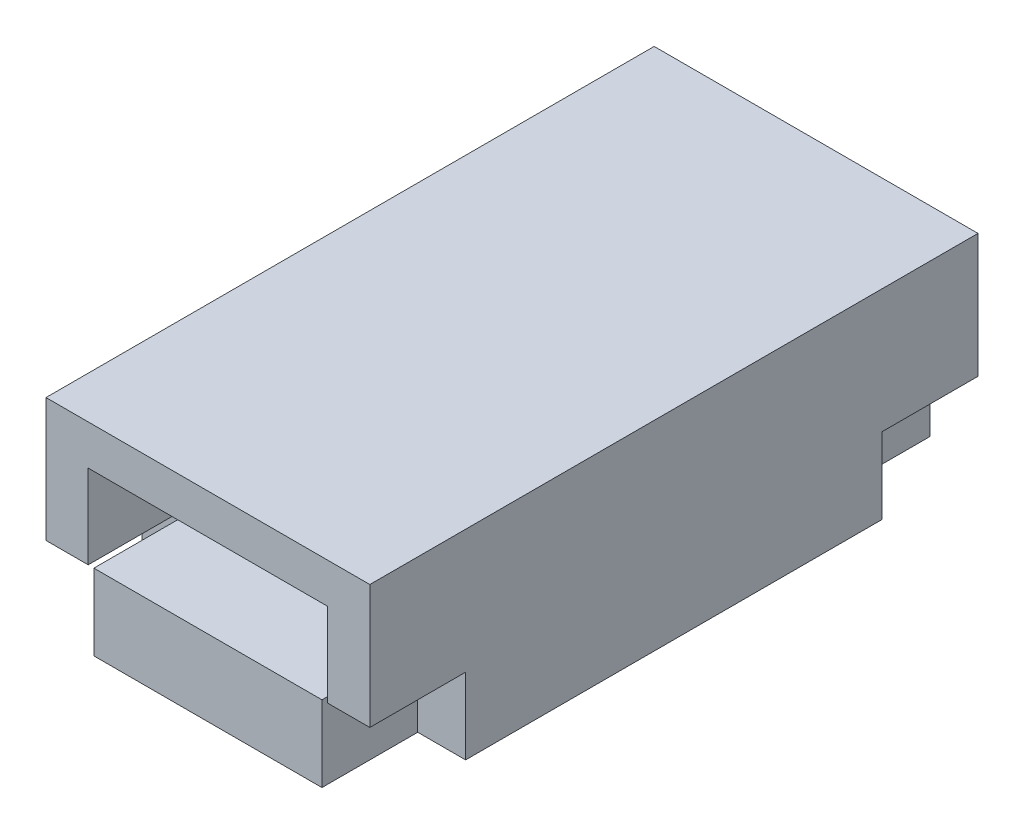
ISO-10303-21;
HEADER;
FILE_DESCRIPTION(('STEP AP214'),'2;1');
FILE_NAME('part.step','',(''),(''),'','','');
FILE_SCHEMA(('AUTOMOTIVE_DESIGN { 1 0 10303 214 1 1 1 1 }'));
ENDSEC;
DATA;
#1=APPLICATION_CONTEXT('core data for automotive mechanical design processes');
#2=APPLICATION_PROTOCOL_DEFINITION('international standard','automotive_design',2000,#1);
#3=PRODUCT_CONTEXT('',#1,'mechanical');
#4=PRODUCT('Part','Part','',(#3));
#5=PRODUCT_RELATED_PRODUCT_CATEGORY('part','',(#4));
#6=PRODUCT_DEFINITION_FORMATION('','',#4);
#7=PRODUCT_DEFINITION_CONTEXT('part definition',#1,'design');
#8=PRODUCT_DEFINITION('design','',#6,#7);
#9=PRODUCT_DEFINITION_SHAPE('','',#8);
#10=(LENGTH_UNIT() NAMED_UNIT(*) SI_UNIT(.MILLI.,.METRE.));
#11=(NAMED_UNIT(*) PLANE_ANGLE_UNIT() SI_UNIT($,.RADIAN.));
#12=(NAMED_UNIT(*) SI_UNIT($,.STERADIAN.) SOLID_ANGLE_UNIT());
#13=UNCERTAINTY_MEASURE_WITH_UNIT(LENGTH_MEASURE(1.E-05),#10,'distance_accuracy_value','');
#14=(GEOMETRIC_REPRESENTATION_CONTEXT(3) GLOBAL_UNCERTAINTY_ASSIGNED_CONTEXT((#13)) GLOBAL_UNIT_ASSIGNED_CONTEXT((#10,
#11,#12)) REPRESENTATION_CONTEXT('',''));
#15=CARTESIAN_POINT('',(0.,0.,0.));
#16=DIRECTION('',(0.,0.,1.));
#17=DIRECTION('',(1.,0.,0.));
#18=AXIS2_PLACEMENT_3D('',#15,#16,#17);
#19=CARTESIAN_POINT('',(-6.7625,-4.925,12.7));
#20=DIRECTION('',(0.,1.,0.));
#21=DIRECTION('',(-1.,0.,0.));
#22=AXIS2_PLACEMENT_3D('',#19,#20,#21);
#23=PLANE('',#22);
#24=DIRECTION('',(0.,0.,-1.));
#25=VECTOR('',#24,1.);
#26=CARTESIAN_POINT('',(-4.7625,-4.925,-8.7));
#27=LINE('',#26,#25);
#28=CARTESIAN_POINT('',(-4.7625,-4.925,-8.7));
#29=VERTEX_POINT('',#28);
#30=CARTESIAN_POINT('',(-4.7625,-4.925,-12.7));
#31=VERTEX_POINT('',#30);
#32=EDGE_CURVE('E253',#29,#31,#27,.T.);
#33=ORIENTED_EDGE('',*,*,#32,.T.);
#34=DIRECTION('',(1.,0.,0.));
#35=VECTOR('',#34,1.);
#36=CARTESIAN_POINT('',(-6.7625,-4.925,-12.7));
#37=LINE('',#36,#35);
#38=CARTESIAN_POINT('',(4.7625,-4.925,-12.7));
#39=VERTEX_POINT('',#38);
#40=EDGE_CURVE('E204',#31,#39,#37,.T.);
#41=ORIENTED_EDGE('',*,*,#40,.T.);
#42=DIRECTION('',(0.,0.,-1.));
#43=VECTOR('',#42,1.);
#44=CARTESIAN_POINT('',(4.7625,-4.925,-8.7));
#45=LINE('',#44,#43);
#46=CARTESIAN_POINT('',(4.7625,-4.925,-8.7));
#47=VERTEX_POINT('',#46);
#48=EDGE_CURVE('E249',#47,#39,#45,.T.);
#49=ORIENTED_EDGE('',*,*,#48,.F.);
#50=DIRECTION('',(1.,0.,0.));
#51=VECTOR('',#50,1.);
#52=CARTESIAN_POINT('',(0.,-4.925,-8.7));
#53=LINE('',#52,#51);
#54=CARTESIAN_POINT('',(6.7625,-4.925,-8.7));
#55=VERTEX_POINT('',#54);
#56=EDGE_CURVE('E274',#47,#55,#53,.T.);
#57=ORIENTED_EDGE('',*,*,#56,.T.);
#58=DIRECTION('',(0.,0.,-1.));
#59=VECTOR('',#58,1.);
#60=CARTESIAN_POINT('',(6.7625,-4.925,12.7));
#61=LINE('',#60,#59);
#62=CARTESIAN_POINT('',(6.7625,-4.925,8.7));
#63=VERTEX_POINT('',#62);
#64=EDGE_CURVE('E50',#63,#55,#61,.T.);
#65=ORIENTED_EDGE('',*,*,#64,.F.);
#66=DIRECTION('',(1.,0.,0.));
#67=VECTOR('',#66,1.);
#68=CARTESIAN_POINT('',(0.,-4.925,8.7));
#69=LINE('',#68,#67);
#70=CARTESIAN_POINT('',(4.7625,-4.925,8.7));
#71=VERTEX_POINT('',#70);
#72=EDGE_CURVE('E329',#71,#63,#69,.T.);
#73=ORIENTED_EDGE('',*,*,#72,.F.);
#74=DIRECTION('',(0.,0.,1.));
#75=VECTOR('',#74,1.);
#76=CARTESIAN_POINT('',(4.7625,-4.925,8.7));
#77=LINE('',#76,#75);
#78=CARTESIAN_POINT('',(4.7625,-4.925,12.7));
#79=VERTEX_POINT('',#78);
#80=EDGE_CURVE('E341',#71,#79,#77,.T.);
#81=ORIENTED_EDGE('',*,*,#80,.T.);
#82=DIRECTION('',(1.,0.,0.));
#83=VECTOR('',#82,1.);
#84=CARTESIAN_POINT('',(-6.7625,-4.925,12.7));
#85=LINE('',#84,#83);
#86=CARTESIAN_POINT('',(-4.7625,-4.925,12.7));
#87=VERTEX_POINT('',#86);
#88=EDGE_CURVE('E403',#87,#79,#85,.T.);
#89=ORIENTED_EDGE('',*,*,#88,.F.);
#90=DIRECTION('',(0.,0.,1.));
#91=VECTOR('',#90,1.);
#92=CARTESIAN_POINT('',(-4.7625,-4.925,8.7));
#93=LINE('',#92,#91);
#94=CARTESIAN_POINT('',(-4.7625,-4.925,8.7));
#95=VERTEX_POINT('',#94);
#96=EDGE_CURVE('E308',#95,#87,#93,.T.);
#97=ORIENTED_EDGE('',*,*,#96,.F.);
#98=DIRECTION('',(1.,0.,0.));
#99=VECTOR('',#98,1.);
#100=CARTESIAN_POINT('',(0.,-4.925,8.7));
#101=LINE('',#100,#99);
#102=CARTESIAN_POINT('',(-6.7625,-4.925,8.7));
#103=VERTEX_POINT('',#102);
#104=EDGE_CURVE('E295',#103,#95,#101,.T.);
#105=ORIENTED_EDGE('',*,*,#104,.F.);
#106=DIRECTION('',(0.,0.,-1.));
#107=VECTOR('',#106,1.);
#108=CARTESIAN_POINT('',(-6.7625,-4.925,12.7));
#109=LINE('',#108,#107);
#110=CARTESIAN_POINT('',(-6.7625,-4.925,-8.7));
#111=VERTEX_POINT('',#110);
#112=EDGE_CURVE('E11',#103,#111,#109,.T.);
#113=ORIENTED_EDGE('',*,*,#112,.T.);
#114=DIRECTION('',(1.,0.,0.));
#115=VECTOR('',#114,1.);
#116=CARTESIAN_POINT('',(0.,-4.925,-8.7));
#117=LINE('',#116,#115);
#118=EDGE_CURVE('E229',#111,#29,#117,.T.);
#119=ORIENTED_EDGE('',*,*,#118,.T.);
#120=EDGE_LOOP('',(#33,#41,#49,#57,#65,#73,#81,#89,#97,#105,#113,#119));
#121=FACE_BOUND('',#120,.T.);
#122=ADVANCED_FACE('F41',(#121),#23,.F.);
#123=CARTESIAN_POINT('',(5.,-1.75,12.7));
#124=DIRECTION('',(0.,1.,0.));
#125=DIRECTION('',(0.,0.,1.));
#126=AXIS2_PLACEMENT_3D('',#123,#124,#125);
#127=PLANE('',#126);
#128=DIRECTION('',(1.,0.,0.));
#129=VECTOR('',#128,1.);
#130=CARTESIAN_POINT('',(5.,-1.75,-12.7));
#131=LINE('',#130,#129);
#132=CARTESIAN_POINT('',(-4.7625,-1.75,-12.7));
#133=VERTEX_POINT('',#132);
#134=CARTESIAN_POINT('',(4.7625,-1.75,-12.7));
#135=VERTEX_POINT('',#134);
#136=EDGE_CURVE('E374',#133,#135,#131,.T.);
#137=ORIENTED_EDGE('',*,*,#136,.F.);
#138=DIRECTION('',(0.,0.,-1.));
#139=VECTOR('',#138,1.);
#140=CARTESIAN_POINT('',(-4.7625,-1.75,-8.7));
#141=LINE('',#140,#139);
#142=CARTESIAN_POINT('',(-4.7625,-1.75,-8.7));
#143=VERTEX_POINT('',#142);
#144=EDGE_CURVE('E258',#143,#133,#141,.T.);
#145=ORIENTED_EDGE('',*,*,#144,.F.);
#146=DIRECTION('',(-1.,0.,0.));
#147=VECTOR('',#146,1.);
#148=CARTESIAN_POINT('',(0.,-1.75,-8.7));
#149=LINE('',#148,#147);
#150=CARTESIAN_POINT('',(-5.,-1.75,-8.7));
#151=VERTEX_POINT('',#150);
#152=EDGE_CURVE('E239',#143,#151,#149,.T.);
#153=ORIENTED_EDGE('',*,*,#152,.T.);
#154=DIRECTION('',(0.,0.,-1.));
#155=VECTOR('',#154,1.);
#156=CARTESIAN_POINT('',(-5.,-1.75,12.7));
#157=LINE('',#156,#155);
#158=CARTESIAN_POINT('',(-5.,-1.75,8.7));
#159=VERTEX_POINT('',#158);
#160=EDGE_CURVE('E400',#159,#151,#157,.T.);
#161=ORIENTED_EDGE('',*,*,#160,.F.);
#162=DIRECTION('',(-1.,0.,0.));
#163=VECTOR('',#162,1.);
#164=CARTESIAN_POINT('',(0.,-1.75,8.7));
#165=LINE('',#164,#163);
#166=CARTESIAN_POINT('',(-4.7625,-1.75,8.7));
#167=VERTEX_POINT('',#166);
#168=EDGE_CURVE('E302',#167,#159,#165,.T.);
#169=ORIENTED_EDGE('',*,*,#168,.F.);
#170=DIRECTION('',(0.,0.,1.));
#171=VECTOR('',#170,1.);
#172=CARTESIAN_POINT('',(-4.7625,-1.75,8.7));
#173=LINE('',#172,#171);
#174=CARTESIAN_POINT('',(-4.7625,-1.75,12.7));
#175=VERTEX_POINT('',#174);
#176=EDGE_CURVE('E319',#167,#175,#173,.T.);
#177=ORIENTED_EDGE('',*,*,#176,.T.);
#178=DIRECTION('',(1.,0.,0.));
#179=VECTOR('',#178,1.);
#180=CARTESIAN_POINT('',(5.,-1.75,12.7));
#181=LINE('',#180,#179);
#182=CARTESIAN_POINT('',(4.7625,-1.75,12.7));
#183=VERTEX_POINT('',#182);
#184=EDGE_CURVE('E359',#175,#183,#181,.T.);
#185=ORIENTED_EDGE('',*,*,#184,.T.);
#186=DIRECTION('',(0.,0.,1.));
#187=VECTOR('',#186,1.);
#188=CARTESIAN_POINT('',(4.7625,-1.75,8.7));
#189=LINE('',#188,#187);
#190=CARTESIAN_POINT('',(4.7625,-1.75,8.7));
#191=VERTEX_POINT('',#190);
#192=EDGE_CURVE('E312',#191,#183,#189,.T.);
#193=ORIENTED_EDGE('',*,*,#192,.F.);
#194=DIRECTION('',(-1.,0.,0.));
#195=VECTOR('',#194,1.);
#196=CARTESIAN_POINT('',(0.,-1.75,8.7));
#197=LINE('',#196,#195);
#198=CARTESIAN_POINT('',(5.,-1.75,8.7));
#199=VERTEX_POINT('',#198);
#200=EDGE_CURVE('E336',#199,#191,#197,.T.);
#201=ORIENTED_EDGE('',*,*,#200,.F.);
#202=DIRECTION('',(0.,0.,-1.));
#203=VECTOR('',#202,1.);
#204=CARTESIAN_POINT('',(5.,-1.75,12.7));
#205=LINE('',#204,#203);
#206=CARTESIAN_POINT('',(5.,-1.75,-8.7));
#207=VERTEX_POINT('',#206);
#208=EDGE_CURVE('E396',#199,#207,#205,.T.);
#209=ORIENTED_EDGE('',*,*,#208,.T.);
#210=DIRECTION('',(-1.,0.,0.));
#211=VECTOR('',#210,1.);
#212=CARTESIAN_POINT('',(0.,-1.75,-8.7));
#213=LINE('',#212,#211);
#214=CARTESIAN_POINT('',(4.7625,-1.75,-8.7));
#215=VERTEX_POINT('',#214);
#216=EDGE_CURVE('E267',#207,#215,#213,.T.);
#217=ORIENTED_EDGE('',*,*,#216,.T.);
#218=DIRECTION('',(0.,0.,-1.));
#219=VECTOR('',#218,1.);
#220=CARTESIAN_POINT('',(4.7625,-1.75,-8.7));
#221=LINE('',#220,#219);
#222=EDGE_CURVE('E277',#215,#135,#221,.T.);
#223=ORIENTED_EDGE('',*,*,#222,.T.);
#224=EDGE_LOOP('',(#137,#145,#153,#161,#169,#177,#185,#193,#201,#209,#217,#223));
#225=FACE_BOUND('',#224,.T.);
#226=ADVANCED_FACE('F434',(#225),#127,.T.);
#227=CARTESIAN_POINT('',(0.,0.,-12.7));
#228=DIRECTION('',(0.,0.,1.));
#229=DIRECTION('',(1.,0.,0.));
#230=AXIS2_PLACEMENT_3D('',#227,#228,#229);
#231=PLANE('',#230);
#232=DIRECTION('',(0.,1.,0.));
#233=VECTOR('',#232,1.);
#234=CARTESIAN_POINT('',(-4.7625,0.,-12.7));
#235=LINE('',#234,#233);
#236=EDGE_CURVE('E234',#31,#133,#235,.T.);
#237=ORIENTED_EDGE('',*,*,#236,.T.);
#238=ORIENTED_EDGE('',*,*,#136,.T.);
#239=DIRECTION('',(0.,1.,0.));
#240=VECTOR('',#239,1.);
#241=CARTESIAN_POINT('',(4.7625,0.,-12.7));
#242=LINE('',#241,#240);
#243=EDGE_CURVE('E223',#39,#135,#242,.T.);
#244=ORIENTED_EDGE('',*,*,#243,.F.);
#245=ORIENTED_EDGE('',*,*,#40,.F.);
#246=EDGE_LOOP('',(#237,#238,#244,#245));
#247=FACE_BOUND('',#246,.T.);
#248=ADVANCED_FACE('F438',(#247),#231,.F.);
#249=DIRECTION('',(-1.,0.,0.));
#250=VECTOR('',#249,1.);
#251=CARTESIAN_POINT('',(0.,-1.75,-12.7));
#252=LINE('',#251,#250);
#253=CARTESIAN_POINT('',(-5.,-1.75,-12.7));
#254=VERTEX_POINT('',#253);
#255=CARTESIAN_POINT('',(-6.7625,-1.75,-12.7));
#256=VERTEX_POINT('',#255);
#257=EDGE_CURVE('E200',#254,#256,#252,.T.);
#258=ORIENTED_EDGE('',*,*,#257,.T.);
#259=DIRECTION('',(0.,-1.,0.));
#260=VECTOR('',#259,1.);
#261=CARTESIAN_POINT('',(-6.7625,2.48121000000001,-12.7));
#262=LINE('',#261,#260);
#263=CARTESIAN_POINT('',(-6.7625,3.42021000000001,-12.7));
#264=VERTEX_POINT('',#263);
#265=EDGE_CURVE('E193',#264,#256,#262,.T.);
#266=ORIENTED_EDGE('',*,*,#265,.F.);
#267=DIRECTION('',(1.,0.,0.));
#268=VECTOR('',#267,1.);
#269=CARTESIAN_POINT('',(0.,3.42021000000001,-12.7));
#270=LINE('',#269,#268);
#271=CARTESIAN_POINT('',(6.7625,3.42021000000001,-12.7));
#272=VERTEX_POINT('',#271);
#273=EDGE_CURVE('E198',#264,#272,#270,.T.);
#274=ORIENTED_EDGE('',*,*,#273,.T.);
#275=DIRECTION('',(0.,1.,0.));
#276=VECTOR('',#275,1.);
#277=CARTESIAN_POINT('',(6.7625,2.48121,-12.7));
#278=LINE('',#277,#276);
#279=CARTESIAN_POINT('',(6.7625,-1.75,-12.7));
#280=VERTEX_POINT('',#279);
#281=EDGE_CURVE('E404',#280,#272,#278,.T.);
#282=ORIENTED_EDGE('',*,*,#281,.F.);
#283=DIRECTION('',(-1.,0.,0.));
#284=VECTOR('',#283,1.);
#285=CARTESIAN_POINT('',(0.,-1.75,-12.7));
#286=LINE('',#285,#284);
#287=CARTESIAN_POINT('',(5.,-1.75,-12.7));
#288=VERTEX_POINT('',#287);
#289=EDGE_CURVE('E226',#280,#288,#286,.T.);
#290=ORIENTED_EDGE('',*,*,#289,.T.);
#291=DIRECTION('',(0.,1.,0.));
#292=VECTOR('',#291,1.);
#293=CARTESIAN_POINT('',(5.,1.75,-12.7));
#294=LINE('',#293,#292);
#295=CARTESIAN_POINT('',(5.,1.75,-12.7));
#296=VERTEX_POINT('',#295);
#297=EDGE_CURVE('E378',#288,#296,#294,.T.);
#298=ORIENTED_EDGE('',*,*,#297,.T.);
#299=DIRECTION('',(-1.,0.,0.));
#300=VECTOR('',#299,1.);
#301=CARTESIAN_POINT('',(5.,1.75,-12.7));
#302=LINE('',#301,#300);
#303=CARTESIAN_POINT('',(-5.,1.75,-12.7));
#304=VERTEX_POINT('',#303);
#305=EDGE_CURVE('E360',#296,#304,#302,.T.);
#306=ORIENTED_EDGE('',*,*,#305,.T.);
#307=DIRECTION('',(0.,-1.,0.));
#308=VECTOR('',#307,1.);
#309=CARTESIAN_POINT('',(-5.,1.75,-12.7));
#310=LINE('',#309,#308);
#311=EDGE_CURVE('E318',#304,#254,#310,.T.);
#312=ORIENTED_EDGE('',*,*,#311,.T.);
#313=EDGE_LOOP('',(#258,#266,#274,#282,#290,#298,#306,#312));
#314=FACE_BOUND('',#313,.T.);
#315=ADVANCED_FACE('F195',(#314),#231,.F.);
#316=CARTESIAN_POINT('',(-6.7625,2.48121000000001,12.7));
#317=DIRECTION('',(1.,0.,0.));
#318=DIRECTION('',(0.,1.,0.));
#319=AXIS2_PLACEMENT_3D('',#316,#317,#318);
#320=PLANE('',#319);
#321=DIRECTION('',(0.,0.,1.));
#322=VECTOR('',#321,1.);
#323=CARTESIAN_POINT('',(-6.7625,3.42021000000001,0.));
#324=LINE('',#323,#322);
#325=CARTESIAN_POINT('',(-6.7625,3.42021000000001,12.7));
#326=VERTEX_POINT('',#325);
#327=EDGE_CURVE('E208',#264,#326,#324,.T.);
#328=ORIENTED_EDGE('',*,*,#327,.F.);
#329=ORIENTED_EDGE('',*,*,#265,.T.);
#330=DIRECTION('',(0.,0.,-1.));
#331=VECTOR('',#330,1.);
#332=CARTESIAN_POINT('',(-6.7625,-1.75,-8.7));
#333=LINE('',#332,#331);
#334=CARTESIAN_POINT('',(-6.7625,-1.75,-8.7));
#335=VERTEX_POINT('',#334);
#336=EDGE_CURVE('E246',#335,#256,#333,.T.);
#337=ORIENTED_EDGE('',*,*,#336,.F.);
#338=DIRECTION('',(0.,-1.,0.));
#339=VECTOR('',#338,1.);
#340=CARTESIAN_POINT('',(-6.7625,0.,-8.7));
#341=LINE('',#340,#339);
#342=EDGE_CURVE('E233',#335,#111,#341,.T.);
#343=ORIENTED_EDGE('',*,*,#342,.T.);
#344=ORIENTED_EDGE('',*,*,#112,.F.);
#345=DIRECTION('',(0.,-1.,0.));
#346=VECTOR('',#345,1.);
#347=CARTESIAN_POINT('',(-6.7625,0.,8.7));
#348=LINE('',#347,#346);
#349=CARTESIAN_POINT('',(-6.7625,-1.75,8.7));
#350=VERTEX_POINT('',#349);
#351=EDGE_CURVE('E305',#350,#103,#348,.T.);
#352=ORIENTED_EDGE('',*,*,#351,.F.);
#353=DIRECTION('',(0.,0.,1.));
#354=VECTOR('',#353,1.);
#355=CARTESIAN_POINT('',(-6.7625,-1.75,8.7));
#356=LINE('',#355,#354);
#357=CARTESIAN_POINT('',(-6.7625,-1.75,12.7));
#358=VERTEX_POINT('',#357);
#359=EDGE_CURVE('E315',#350,#358,#356,.T.);
#360=ORIENTED_EDGE('',*,*,#359,.T.);
#361=DIRECTION('',(0.,-1.,0.));
#362=VECTOR('',#361,1.);
#363=CARTESIAN_POINT('',(-6.7625,2.48121000000001,12.7));
#364=LINE('',#363,#362);
#365=EDGE_CURVE('E211',#326,#358,#364,.T.);
#366=ORIENTED_EDGE('',*,*,#365,.F.);
#367=EDGE_LOOP('',(#328,#329,#337,#343,#344,#352,#360,#366));
#368=FACE_BOUND('',#367,.T.);
#369=ADVANCED_FACE('F43',(#368),#320,.F.);
#370=CARTESIAN_POINT('',(6.7625,2.48121,12.7));
#371=DIRECTION('',(-1.,0.,0.));
#372=DIRECTION('',(0.,0.,1.));
#373=AXIS2_PLACEMENT_3D('',#370,#371,#372);
#374=PLANE('',#373);
#375=ORIENTED_EDGE('',*,*,#281,.T.);
#376=DIRECTION('',(0.,0.,1.));
#377=VECTOR('',#376,1.);
#378=CARTESIAN_POINT('',(6.7625,3.42021000000001,0.));
#379=LINE('',#378,#377);
#380=CARTESIAN_POINT('',(6.7625,3.42021000000001,12.7));
#381=VERTEX_POINT('',#380);
#382=EDGE_CURVE('E217',#272,#381,#379,.T.);
#383=ORIENTED_EDGE('',*,*,#382,.T.);
#384=DIRECTION('',(0.,1.,0.));
#385=VECTOR('',#384,1.);
#386=CARTESIAN_POINT('',(6.7625,2.48121,12.7));
#387=LINE('',#386,#385);
#388=CARTESIAN_POINT('',(6.7625,-1.75,12.7));
#389=VERTEX_POINT('',#388);
#390=EDGE_CURVE('E408',#389,#381,#387,.T.);
#391=ORIENTED_EDGE('',*,*,#390,.F.);
#392=DIRECTION('',(0.,0.,1.));
#393=VECTOR('',#392,1.);
#394=CARTESIAN_POINT('',(6.7625,-1.75,8.7));
#395=LINE('',#394,#393);
#396=CARTESIAN_POINT('',(6.7625,-1.75,8.7));
#397=VERTEX_POINT('',#396);
#398=EDGE_CURVE('E349',#397,#389,#395,.T.);
#399=ORIENTED_EDGE('',*,*,#398,.F.);
#400=DIRECTION('',(0.,1.,0.));
#401=VECTOR('',#400,1.);
#402=CARTESIAN_POINT('',(6.7625,0.,8.7));
#403=LINE('',#402,#401);
#404=EDGE_CURVE('E333',#63,#397,#403,.T.);
#405=ORIENTED_EDGE('',*,*,#404,.F.);
#406=ORIENTED_EDGE('',*,*,#64,.T.);
#407=DIRECTION('',(0.,1.,0.));
#408=VECTOR('',#407,1.);
#409=CARTESIAN_POINT('',(6.7625,0.,-8.7));
#410=LINE('',#409,#408);
#411=CARTESIAN_POINT('',(6.7625,-1.75,-8.7));
#412=VERTEX_POINT('',#411);
#413=EDGE_CURVE('E270',#55,#412,#410,.T.);
#414=ORIENTED_EDGE('',*,*,#413,.T.);
#415=DIRECTION('',(0.,0.,-1.));
#416=VECTOR('',#415,1.);
#417=CARTESIAN_POINT('',(6.7625,-1.75,-8.7));
#418=LINE('',#417,#416);
#419=EDGE_CURVE('E284',#412,#280,#418,.T.);
#420=ORIENTED_EDGE('',*,*,#419,.T.);
#421=EDGE_LOOP('',(#375,#383,#391,#399,#405,#406,#414,#420));
#422=FACE_BOUND('',#421,.T.);
#423=ADVANCED_FACE('F420',(#422),#374,.F.);
#424=CARTESIAN_POINT('',(0.,0.,12.7));
#425=DIRECTION('',(0.,0.,1.));
#426=DIRECTION('',(1.,0.,0.));
#427=AXIS2_PLACEMENT_3D('',#424,#425,#426);
#428=PLANE('',#427);
#429=DIRECTION('',(-1.,0.,0.));
#430=VECTOR('',#429,1.);
#431=CARTESIAN_POINT('',(0.,-1.75,12.7));
#432=LINE('',#431,#430);
#433=CARTESIAN_POINT('',(-5.,-1.75,12.7));
#434=VERTEX_POINT('',#433);
#435=EDGE_CURVE('E298',#434,#358,#432,.T.);
#436=ORIENTED_EDGE('',*,*,#435,.F.);
#437=DIRECTION('',(0.,-1.,0.));
#438=VECTOR('',#437,1.);
#439=CARTESIAN_POINT('',(-5.,1.75,12.7));
#440=LINE('',#439,#438);
#441=CARTESIAN_POINT('',(-5.,1.75,12.7));
#442=VERTEX_POINT('',#441);
#443=EDGE_CURVE('E355',#442,#434,#440,.T.);
#444=ORIENTED_EDGE('',*,*,#443,.F.);
#445=DIRECTION('',(-1.,0.,0.));
#446=VECTOR('',#445,1.);
#447=CARTESIAN_POINT('',(5.,1.75,12.7));
#448=LINE('',#447,#446);
#449=CARTESIAN_POINT('',(5.,1.75,12.7));
#450=VERTEX_POINT('',#449);
#451=EDGE_CURVE('E368',#450,#442,#448,.T.);
#452=ORIENTED_EDGE('',*,*,#451,.F.);
#453=DIRECTION('',(0.,1.,0.));
#454=VECTOR('',#453,1.);
#455=CARTESIAN_POINT('',(5.,1.75,12.7));
#456=LINE('',#455,#454);
#457=CARTESIAN_POINT('',(5.,-1.75,12.7));
#458=VERTEX_POINT('',#457);
#459=EDGE_CURVE('E364',#458,#450,#456,.T.);
#460=ORIENTED_EDGE('',*,*,#459,.F.);
#461=DIRECTION('',(-1.,0.,0.));
#462=VECTOR('',#461,1.);
#463=CARTESIAN_POINT('',(0.,-1.75,12.7));
#464=LINE('',#463,#462);
#465=EDGE_CURVE('E330',#389,#458,#464,.T.);
#466=ORIENTED_EDGE('',*,*,#465,.F.);
#467=ORIENTED_EDGE('',*,*,#390,.T.);
#468=DIRECTION('',(1.,0.,0.));
#469=VECTOR('',#468,1.);
#470=CARTESIAN_POINT('',(0.,3.42021000000001,12.7));
#471=LINE('',#470,#469);
#472=EDGE_CURVE('E257',#326,#381,#471,.T.);
#473=ORIENTED_EDGE('',*,*,#472,.F.);
#474=ORIENTED_EDGE('',*,*,#365,.T.);
#475=EDGE_LOOP('',(#436,#444,#452,#460,#466,#467,#473,#474));
#476=FACE_BOUND('',#475,.T.);
#477=ADVANCED_FACE('F474',(#476),#428,.T.);
#478=DIRECTION('',(0.,1.,0.));
#479=VECTOR('',#478,1.);
#480=CARTESIAN_POINT('',(-4.7625,0.,12.7));
#481=LINE('',#480,#479);
#482=EDGE_CURVE('E309',#87,#175,#481,.T.);
#483=ORIENTED_EDGE('',*,*,#482,.F.);
#484=ORIENTED_EDGE('',*,*,#88,.T.);
#485=DIRECTION('',(0.,1.,0.));
#486=VECTOR('',#485,1.);
#487=CARTESIAN_POINT('',(4.7625,0.,12.7));
#488=LINE('',#487,#486);
#489=EDGE_CURVE('E216',#79,#183,#488,.T.);
#490=ORIENTED_EDGE('',*,*,#489,.T.);
#491=ORIENTED_EDGE('',*,*,#184,.F.);
#492=EDGE_LOOP('',(#483,#484,#490,#491));
#493=FACE_BOUND('',#492,.T.);
#494=ADVANCED_FACE('F513',(#493),#428,.T.);
#495=CARTESIAN_POINT('',(-5.,1.75,12.7));
#496=DIRECTION('',(1.,0.,0.));
#497=DIRECTION('',(0.,1.,0.));
#498=AXIS2_PLACEMENT_3D('',#495,#496,#497);
#499=PLANE('',#498);
#500=ORIENTED_EDGE('',*,*,#311,.F.);
#501=DIRECTION('',(0.,0.,-1.));
#502=VECTOR('',#501,1.);
#503=CARTESIAN_POINT('',(-5.,1.75,12.7));
#504=LINE('',#503,#502);
#505=EDGE_CURVE('E371',#442,#304,#504,.T.);
#506=ORIENTED_EDGE('',*,*,#505,.F.);
#507=ORIENTED_EDGE('',*,*,#443,.T.);
#508=EDGE_CURVE('E205',#434,#159,#157,.T.);
#509=ORIENTED_EDGE('',*,*,#508,.T.);
#510=ORIENTED_EDGE('',*,*,#160,.T.);
#511=EDGE_CURVE('E395',#151,#254,#157,.T.);
#512=ORIENTED_EDGE('',*,*,#511,.T.);
#513=EDGE_LOOP('',(#500,#506,#507,#509,#510,#512));
#514=FACE_BOUND('',#513,.T.);
#515=ADVANCED_FACE('F465',(#514),#499,.T.);
#516=CARTESIAN_POINT('',(5.,1.75,12.7));
#517=DIRECTION('',(-1.,0.,0.));
#518=DIRECTION('',(0.,-1.,0.));
#519=AXIS2_PLACEMENT_3D('',#516,#517,#518);
#520=PLANE('',#519);
#521=ORIENTED_EDGE('',*,*,#297,.F.);
#522=EDGE_CURVE('E391',#207,#288,#205,.T.);
#523=ORIENTED_EDGE('',*,*,#522,.F.);
#524=ORIENTED_EDGE('',*,*,#208,.F.);
#525=EDGE_CURVE('E392',#458,#199,#205,.T.);
#526=ORIENTED_EDGE('',*,*,#525,.F.);
#527=ORIENTED_EDGE('',*,*,#459,.T.);
#528=DIRECTION('',(0.,0.,-1.));
#529=VECTOR('',#528,1.);
#530=CARTESIAN_POINT('',(5.,1.75,12.7));
#531=LINE('',#530,#529);
#532=EDGE_CURVE('E388',#450,#296,#531,.T.);
#533=ORIENTED_EDGE('',*,*,#532,.T.);
#534=EDGE_LOOP('',(#521,#523,#524,#526,#527,#533));
#535=FACE_BOUND('',#534,.T.);
#536=ADVANCED_FACE('F482',(#535),#520,.T.);
#537=CARTESIAN_POINT('',(5.,1.75,12.7));
#538=DIRECTION('',(0.,-1.,0.));
#539=DIRECTION('',(0.,0.,-1.));
#540=AXIS2_PLACEMENT_3D('',#537,#538,#539);
#541=PLANE('',#540);
#542=ORIENTED_EDGE('',*,*,#305,.F.);
#543=ORIENTED_EDGE('',*,*,#532,.F.);
#544=ORIENTED_EDGE('',*,*,#451,.T.);
#545=ORIENTED_EDGE('',*,*,#505,.T.);
#546=EDGE_LOOP('',(#542,#543,#544,#545));
#547=FACE_BOUND('',#546,.T.);
#548=ADVANCED_FACE('F488',(#547),#541,.T.);
#549=CARTESIAN_POINT('',(4.7625,0.,8.7));
#550=DIRECTION('',(1.,0.,0.));
#551=DIRECTION('',(0.,0.,-1.));
#552=AXIS2_PLACEMENT_3D('',#549,#550,#551);
#553=PLANE('',#552);
#554=ORIENTED_EDGE('',*,*,#489,.F.);
#555=ORIENTED_EDGE('',*,*,#80,.F.);
#556=DIRECTION('',(0.,1.,0.));
#557=VECTOR('',#556,1.);
#558=CARTESIAN_POINT('',(4.7625,0.,8.7));
#559=LINE('',#558,#557);
#560=EDGE_CURVE('E325',#71,#191,#559,.T.);
#561=ORIENTED_EDGE('',*,*,#560,.T.);
#562=ORIENTED_EDGE('',*,*,#192,.T.);
#563=EDGE_LOOP('',(#554,#555,#561,#562));
#564=FACE_BOUND('',#563,.T.);
#565=ADVANCED_FACE('F491',(#564),#553,.T.);
#566=CARTESIAN_POINT('',(0.,-1.75,8.7));
#567=DIRECTION('',(0.,1.,0.));
#568=DIRECTION('',(0.,0.,1.));
#569=AXIS2_PLACEMENT_3D('',#566,#567,#568);
#570=PLANE('',#569);
#571=ORIENTED_EDGE('',*,*,#525,.T.);
#572=EDGE_CURVE('E337',#397,#199,#197,.T.);
#573=ORIENTED_EDGE('',*,*,#572,.F.);
#574=ORIENTED_EDGE('',*,*,#398,.T.);
#575=ORIENTED_EDGE('',*,*,#465,.T.);
#576=EDGE_LOOP('',(#571,#573,#574,#575));
#577=FACE_BOUND('',#576,.T.);
#578=ADVANCED_FACE('F497',(#577),#570,.F.);
#579=CARTESIAN_POINT('',(0.,0.,8.7));
#580=DIRECTION('',(0.,0.,1.));
#581=DIRECTION('',(1.,0.,0.));
#582=AXIS2_PLACEMENT_3D('',#579,#580,#581);
#583=PLANE('',#582);
#584=ORIENTED_EDGE('',*,*,#560,.F.);
#585=ORIENTED_EDGE('',*,*,#72,.T.);
#586=ORIENTED_EDGE('',*,*,#404,.T.);
#587=ORIENTED_EDGE('',*,*,#572,.T.);
#588=ORIENTED_EDGE('',*,*,#200,.T.);
#589=EDGE_LOOP('',(#584,#585,#586,#587,#588));
#590=FACE_BOUND('',#589,.T.);
#591=ADVANCED_FACE('F528',(#590),#583,.T.);
#592=CARTESIAN_POINT('',(0.,-1.75,8.7));
#593=DIRECTION('',(0.,1.,0.));
#594=DIRECTION('',(0.,0.,1.));
#595=AXIS2_PLACEMENT_3D('',#592,#593,#594);
#596=PLANE('',#595);
#597=ORIENTED_EDGE('',*,*,#508,.F.);
#598=ORIENTED_EDGE('',*,*,#435,.T.);
#599=ORIENTED_EDGE('',*,*,#359,.F.);
#600=EDGE_CURVE('E301',#159,#350,#165,.T.);
#601=ORIENTED_EDGE('',*,*,#600,.F.);
#602=EDGE_LOOP('',(#597,#598,#599,#601));
#603=FACE_BOUND('',#602,.T.);
#604=ADVANCED_FACE('F471',(#603),#596,.F.);
#605=CARTESIAN_POINT('',(-4.7625,0.,8.7));
#606=DIRECTION('',(1.,0.,0.));
#607=DIRECTION('',(0.,0.,-1.));
#608=AXIS2_PLACEMENT_3D('',#605,#606,#607);
#609=PLANE('',#608);
#610=ORIENTED_EDGE('',*,*,#482,.T.);
#611=ORIENTED_EDGE('',*,*,#176,.F.);
#612=DIRECTION('',(0.,1.,0.));
#613=VECTOR('',#612,1.);
#614=CARTESIAN_POINT('',(-4.7625,0.,8.7));
#615=LINE('',#614,#613);
#616=EDGE_CURVE('E65',#95,#167,#615,.T.);
#617=ORIENTED_EDGE('',*,*,#616,.F.);
#618=ORIENTED_EDGE('',*,*,#96,.T.);
#619=EDGE_LOOP('',(#610,#611,#617,#618));
#620=FACE_BOUND('',#619,.T.);
#621=ADVANCED_FACE('F539',(#620),#609,.F.);
#622=CARTESIAN_POINT('',(0.,0.,8.7));
#623=DIRECTION('',(0.,0.,1.));
#624=DIRECTION('',(1.,0.,0.));
#625=AXIS2_PLACEMENT_3D('',#622,#623,#624);
#626=PLANE('',#625);
#627=ORIENTED_EDGE('',*,*,#104,.T.);
#628=ORIENTED_EDGE('',*,*,#616,.T.);
#629=ORIENTED_EDGE('',*,*,#168,.T.);
#630=ORIENTED_EDGE('',*,*,#600,.T.);
#631=ORIENTED_EDGE('',*,*,#351,.T.);
#632=EDGE_LOOP('',(#627,#628,#629,#630,#631));
#633=FACE_BOUND('',#632,.T.);
#634=ADVANCED_FACE('F468',(#633),#626,.T.);
#635=CARTESIAN_POINT('',(0.,3.42021000000001,0.));
#636=DIRECTION('',(0.,-1.,0.));
#637=DIRECTION('',(0.,0.,-1.));
#638=AXIS2_PLACEMENT_3D('',#635,#636,#637);
#639=PLANE('',#638);
#640=ORIENTED_EDGE('',*,*,#472,.T.);
#641=ORIENTED_EDGE('',*,*,#382,.F.);
#642=ORIENTED_EDGE('',*,*,#273,.F.);
#643=ORIENTED_EDGE('',*,*,#327,.T.);
#644=EDGE_LOOP('',(#640,#641,#642,#643));
#645=FACE_BOUND('',#644,.T.);
#646=ADVANCED_FACE('F220',(#645),#639,.F.);
#647=CARTESIAN_POINT('',(4.7625,0.,-8.7));
#648=DIRECTION('',(-1.,0.,0.));
#649=DIRECTION('',(0.,0.,1.));
#650=AXIS2_PLACEMENT_3D('',#647,#648,#649);
#651=PLANE('',#650);
#652=ORIENTED_EDGE('',*,*,#243,.T.);
#653=ORIENTED_EDGE('',*,*,#222,.F.);
#654=DIRECTION('',(0.,1.,0.));
#655=VECTOR('',#654,1.);
#656=CARTESIAN_POINT('',(4.7625,0.,-8.7));
#657=LINE('',#656,#655);
#658=EDGE_CURVE('E263',#47,#215,#657,.T.);
#659=ORIENTED_EDGE('',*,*,#658,.F.);
#660=ORIENTED_EDGE('',*,*,#48,.T.);
#661=EDGE_LOOP('',(#652,#653,#659,#660));
#662=FACE_BOUND('',#661,.T.);
#663=ADVANCED_FACE('F430',(#662),#651,.F.);
#664=CARTESIAN_POINT('',(0.,-1.75,-8.7));
#665=DIRECTION('',(0.,-1.,0.));
#666=DIRECTION('',(0.,0.,-1.));
#667=AXIS2_PLACEMENT_3D('',#664,#665,#666);
#668=PLANE('',#667);
#669=ORIENTED_EDGE('',*,*,#289,.F.);
#670=ORIENTED_EDGE('',*,*,#419,.F.);
#671=EDGE_CURVE('E57',#412,#207,#213,.T.);
#672=ORIENTED_EDGE('',*,*,#671,.T.);
#673=ORIENTED_EDGE('',*,*,#522,.T.);
#674=EDGE_LOOP('',(#669,#670,#672,#673));
#675=FACE_BOUND('',#674,.T.);
#676=ADVANCED_FACE('F550',(#675),#668,.T.);
#677=CARTESIAN_POINT('',(0.,0.,-8.7));
#678=DIRECTION('',(0.,0.,-1.));
#679=DIRECTION('',(1.,0.,0.));
#680=AXIS2_PLACEMENT_3D('',#677,#678,#679);
#681=PLANE('',#680);
#682=ORIENTED_EDGE('',*,*,#658,.T.);
#683=ORIENTED_EDGE('',*,*,#216,.F.);
#684=ORIENTED_EDGE('',*,*,#671,.F.);
#685=ORIENTED_EDGE('',*,*,#413,.F.);
#686=ORIENTED_EDGE('',*,*,#56,.F.);
#687=EDGE_LOOP('',(#682,#683,#684,#685,#686));
#688=FACE_BOUND('',#687,.T.);
#689=ADVANCED_FACE('F427',(#688),#681,.T.);
#690=CARTESIAN_POINT('',(-4.7625,0.,-8.7));
#691=DIRECTION('',(-1.,0.,0.));
#692=DIRECTION('',(0.,0.,1.));
#693=AXIS2_PLACEMENT_3D('',#690,#691,#692);
#694=PLANE('',#693);
#695=ORIENTED_EDGE('',*,*,#236,.F.);
#696=ORIENTED_EDGE('',*,*,#32,.F.);
#697=DIRECTION('',(0.,1.,0.));
#698=VECTOR('',#697,1.);
#699=CARTESIAN_POINT('',(-4.7625,0.,-8.7));
#700=LINE('',#699,#698);
#701=EDGE_CURVE('E243',#29,#143,#700,.T.);
#702=ORIENTED_EDGE('',*,*,#701,.T.);
#703=ORIENTED_EDGE('',*,*,#144,.T.);
#704=EDGE_LOOP('',(#695,#696,#702,#703));
#705=FACE_BOUND('',#704,.T.);
#706=ADVANCED_FACE('F442',(#705),#694,.T.);
#707=CARTESIAN_POINT('',(0.,-1.75,-8.7));
#708=DIRECTION('',(0.,-1.,0.));
#709=DIRECTION('',(0.,0.,-1.));
#710=AXIS2_PLACEMENT_3D('',#707,#708,#709);
#711=PLANE('',#710);
#712=EDGE_CURVE('E238',#151,#335,#149,.T.);
#713=ORIENTED_EDGE('',*,*,#712,.T.);
#714=ORIENTED_EDGE('',*,*,#336,.T.);
#715=ORIENTED_EDGE('',*,*,#257,.F.);
#716=ORIENTED_EDGE('',*,*,#511,.F.);
#717=EDGE_LOOP('',(#713,#714,#715,#716));
#718=FACE_BOUND('',#717,.T.);
#719=ADVANCED_FACE('F452',(#718),#711,.T.);
#720=CARTESIAN_POINT('',(0.,0.,-8.7));
#721=DIRECTION('',(0.,0.,-1.));
#722=DIRECTION('',(1.,0.,0.));
#723=AXIS2_PLACEMENT_3D('',#720,#721,#722);
#724=PLANE('',#723);
#725=ORIENTED_EDGE('',*,*,#118,.F.);
#726=ORIENTED_EDGE('',*,*,#342,.F.);
#727=ORIENTED_EDGE('',*,*,#712,.F.);
#728=ORIENTED_EDGE('',*,*,#152,.F.);
#729=ORIENTED_EDGE('',*,*,#701,.F.);
#730=EDGE_LOOP('',(#725,#726,#727,#728,#729));
#731=FACE_BOUND('',#730,.T.);
#732=ADVANCED_FACE('F447',(#731),#724,.T.);
#733=CLOSED_SHELL('',(#122,#226,#248,#315,#369,#423,#477,#494,#515,#536,#548,#565,#578,#591,
#604,#621,#634,#646,#663,#676,#689,#706,#719,#732));
#734=MANIFOLD_SOLID_BREP('B2',#733);
#735=ADVANCED_BREP_SHAPE_REPRESENTATION('',(#18,#734),#14);
#736=SHAPE_DEFINITION_REPRESENTATION(#9,#735);
ENDSEC;
END-ISO-10303-21;
